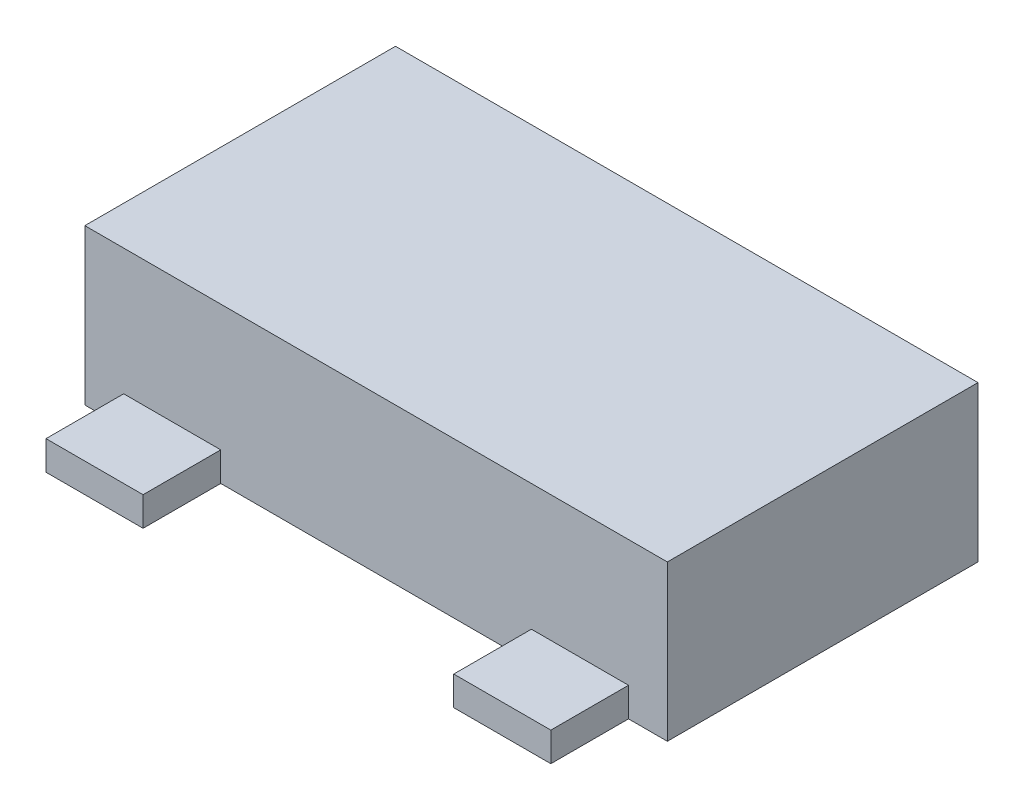
ISO-10303-21;
HEADER;
FILE_DESCRIPTION(('STEP AP214'),'2;1');
FILE_NAME('part.step','',(''),(''),'','','');
FILE_SCHEMA(('AUTOMOTIVE_DESIGN { 1 0 10303 214 1 1 1 1 }'));
ENDSEC;
DATA;
#1=APPLICATION_CONTEXT('core data for automotive mechanical design processes');
#2=APPLICATION_PROTOCOL_DEFINITION('international standard','automotive_design',2000,#1);
#3=PRODUCT_CONTEXT('',#1,'mechanical');
#4=PRODUCT('Part','Part','',(#3));
#5=PRODUCT_RELATED_PRODUCT_CATEGORY('part','',(#4));
#6=PRODUCT_DEFINITION_FORMATION('','',#4);
#7=PRODUCT_DEFINITION_CONTEXT('part definition',#1,'design');
#8=PRODUCT_DEFINITION('design','',#6,#7);
#9=PRODUCT_DEFINITION_SHAPE('','',#8);
#10=(LENGTH_UNIT() NAMED_UNIT(*) SI_UNIT(.MILLI.,.METRE.));
#11=(NAMED_UNIT(*) PLANE_ANGLE_UNIT() SI_UNIT($,.RADIAN.));
#12=(NAMED_UNIT(*) SI_UNIT($,.STERADIAN.) SOLID_ANGLE_UNIT());
#13=UNCERTAINTY_MEASURE_WITH_UNIT(LENGTH_MEASURE(1.E-05),#10,'distance_accuracy_value','');
#14=(GEOMETRIC_REPRESENTATION_CONTEXT(3) GLOBAL_UNCERTAINTY_ASSIGNED_CONTEXT((#13)) GLOBAL_UNIT_ASSIGNED_CONTEXT((#10,
#11,#12)) REPRESENTATION_CONTEXT('',''));
#15=CARTESIAN_POINT('',(0.,0.,0.));
#16=DIRECTION('',(0.,0.,1.));
#17=DIRECTION('',(1.,0.,0.));
#18=AXIS2_PLACEMENT_3D('',#15,#16,#17);
#19=CARTESIAN_POINT('',(-1.5,0.8,0.8));
#20=DIRECTION('',(0.,0.,-1.));
#21=DIRECTION('',(-1.,0.,0.));
#22=AXIS2_PLACEMENT_3D('',#19,#20,#21);
#23=PLANE('',#22);
#24=DIRECTION('',(-1.,0.,0.));
#25=VECTOR('',#24,1.);
#26=CARTESIAN_POINT('',(1.3,0.15,0.8));
#27=LINE('',#26,#25);
#28=CARTESIAN_POINT('',(1.3,0.15,0.8));
#29=VERTEX_POINT('',#28);
#30=CARTESIAN_POINT('',(0.8,0.15,0.8));
#31=VERTEX_POINT('',#30);
#32=EDGE_CURVE('E53',#29,#31,#27,.T.);
#33=ORIENTED_EDGE('',*,*,#32,.F.);
#34=DIRECTION('',(0.,-1.,0.));
#35=VECTOR('',#34,1.);
#36=CARTESIAN_POINT('',(1.3,0.790312423743285,0.8));
#37=LINE('',#36,#35);
#38=CARTESIAN_POINT('',(1.3,0.,0.8));
#39=VERTEX_POINT('',#38);
#40=EDGE_CURVE('E161',#29,#39,#37,.T.);
#41=ORIENTED_EDGE('',*,*,#40,.T.);
#42=DIRECTION('',(1.,0.,0.));
#43=VECTOR('',#42,1.);
#44=CARTESIAN_POINT('',(-1.5,0.,0.8));
#45=LINE('',#44,#43);
#46=CARTESIAN_POINT('',(1.5,0.,0.8));
#47=VERTEX_POINT('',#46);
#48=EDGE_CURVE('E146',#39,#47,#45,.T.);
#49=ORIENTED_EDGE('',*,*,#48,.T.);
#50=DIRECTION('',(0.,-1.,0.));
#51=VECTOR('',#50,1.);
#52=CARTESIAN_POINT('',(1.5,0.8,0.8));
#53=LINE('',#52,#51);
#54=CARTESIAN_POINT('',(1.5,0.8,0.8));
#55=VERTEX_POINT('',#54);
#56=EDGE_CURVE('E248',#55,#47,#53,.T.);
#57=ORIENTED_EDGE('',*,*,#56,.F.);
#58=DIRECTION('',(1.,0.,0.));
#59=VECTOR('',#58,1.);
#60=CARTESIAN_POINT('',(-1.5,0.8,0.8));
#61=LINE('',#60,#59);
#62=CARTESIAN_POINT('',(-1.5,0.8,0.8));
#63=VERTEX_POINT('',#62);
#64=EDGE_CURVE('E246',#63,#55,#61,.T.);
#65=ORIENTED_EDGE('',*,*,#64,.F.);
#66=DIRECTION('',(0.,-1.,0.));
#67=VECTOR('',#66,1.);
#68=CARTESIAN_POINT('',(-1.5,0.8,0.8));
#69=LINE('',#68,#67);
#70=CARTESIAN_POINT('',(-1.5,0.,0.8));
#71=VERTEX_POINT('',#70);
#72=EDGE_CURVE('E257',#63,#71,#69,.T.);
#73=ORIENTED_EDGE('',*,*,#72,.T.);
#74=CARTESIAN_POINT('',(-1.3,0.,0.8));
#75=VERTEX_POINT('',#74);
#76=EDGE_CURVE('E159',#71,#75,#45,.T.);
#77=ORIENTED_EDGE('',*,*,#76,.T.);
#78=DIRECTION('',(0.,-1.,0.));
#79=VECTOR('',#78,1.);
#80=CARTESIAN_POINT('',(-1.3,0.790312423743285,0.8));
#81=LINE('',#80,#79);
#82=CARTESIAN_POINT('',(-1.3,0.15,0.8));
#83=VERTEX_POINT('',#82);
#84=EDGE_CURVE('E204',#83,#75,#81,.T.);
#85=ORIENTED_EDGE('',*,*,#84,.F.);
#86=DIRECTION('',(1.,0.,0.));
#87=VECTOR('',#86,1.);
#88=CARTESIAN_POINT('',(-1.3,0.15,0.8));
#89=LINE('',#88,#87);
#90=CARTESIAN_POINT('',(-0.8,0.15,0.8));
#91=VERTEX_POINT('',#90);
#92=EDGE_CURVE('E190',#83,#91,#89,.T.);
#93=ORIENTED_EDGE('',*,*,#92,.T.);
#94=DIRECTION('',(0.,-1.,0.));
#95=VECTOR('',#94,1.);
#96=CARTESIAN_POINT('',(-0.8,0.790312423743285,0.8));
#97=LINE('',#96,#95);
#98=CARTESIAN_POINT('',(-0.8,0.,0.8));
#99=VERTEX_POINT('',#98);
#100=EDGE_CURVE('E206',#91,#99,#97,.T.);
#101=ORIENTED_EDGE('',*,*,#100,.T.);
#102=CARTESIAN_POINT('',(0.8,0.,0.8));
#103=VERTEX_POINT('',#102);
#104=EDGE_CURVE('E156',#99,#103,#45,.T.);
#105=ORIENTED_EDGE('',*,*,#104,.T.);
#106=DIRECTION('',(0.,-1.,0.));
#107=VECTOR('',#106,1.);
#108=CARTESIAN_POINT('',(0.8,0.790312423743285,0.8));
#109=LINE('',#108,#107);
#110=EDGE_CURVE('E49',#31,#103,#109,.T.);
#111=ORIENTED_EDGE('',*,*,#110,.F.);
#112=EDGE_LOOP('',(#33,#41,#49,#57,#65,#73,#77,#85,#93,#101,#105,#111));
#113=FACE_BOUND('',#112,.T.);
#114=ADVANCED_FACE('F34',(#113),#23,.F.);
#115=CARTESIAN_POINT('',(-1.5,0.8,-0.8));
#116=DIRECTION('',(0.,0.,1.));
#117=DIRECTION('',(1.,0.,0.));
#118=AXIS2_PLACEMENT_3D('',#115,#116,#117);
#119=PLANE('',#118);
#120=DIRECTION('',(0.,-1.,0.));
#121=VECTOR('',#120,1.);
#122=CARTESIAN_POINT('',(0.25,0.15,-0.8));
#123=LINE('',#122,#121);
#124=CARTESIAN_POINT('',(0.25,0.15,-0.8));
#125=VERTEX_POINT('',#124);
#126=CARTESIAN_POINT('',(0.25,0.,-0.8));
#127=VERTEX_POINT('',#126);
#128=EDGE_CURVE('E234',#125,#127,#123,.T.);
#129=ORIENTED_EDGE('',*,*,#128,.F.);
#130=DIRECTION('',(1.,0.,0.));
#131=VECTOR('',#130,1.);
#132=CARTESIAN_POINT('',(-0.25,0.15,-0.8));
#133=LINE('',#132,#131);
#134=CARTESIAN_POINT('',(-0.25,0.15,-0.8));
#135=VERTEX_POINT('',#134);
#136=EDGE_CURVE('E217',#135,#125,#133,.T.);
#137=ORIENTED_EDGE('',*,*,#136,.F.);
#138=DIRECTION('',(0.,-1.,0.));
#139=VECTOR('',#138,1.);
#140=CARTESIAN_POINT('',(-0.25,0.15,-0.8));
#141=LINE('',#140,#139);
#142=CARTESIAN_POINT('',(-0.25,0.,-0.8));
#143=VERTEX_POINT('',#142);
#144=EDGE_CURVE('E236',#135,#143,#141,.T.);
#145=ORIENTED_EDGE('',*,*,#144,.T.);
#146=DIRECTION('',(-1.,0.,0.));
#147=VECTOR('',#146,1.);
#148=CARTESIAN_POINT('',(-1.5,0.,-0.8));
#149=LINE('',#148,#147);
#150=CARTESIAN_POINT('',(-1.5,0.,-0.8));
#151=VERTEX_POINT('',#150);
#152=EDGE_CURVE('E250',#143,#151,#149,.T.);
#153=ORIENTED_EDGE('',*,*,#152,.T.);
#154=DIRECTION('',(0.,-1.,0.));
#155=VECTOR('',#154,1.);
#156=CARTESIAN_POINT('',(-1.5,0.8,-0.8));
#157=LINE('',#156,#155);
#158=CARTESIAN_POINT('',(-1.5,0.8,-0.8));
#159=VERTEX_POINT('',#158);
#160=EDGE_CURVE('E42',#159,#151,#157,.T.);
#161=ORIENTED_EDGE('',*,*,#160,.F.);
#162=DIRECTION('',(-1.,0.,0.));
#163=VECTOR('',#162,1.);
#164=CARTESIAN_POINT('',(-1.5,0.8,-0.8));
#165=LINE('',#164,#163);
#166=CARTESIAN_POINT('',(1.5,0.8,-0.8));
#167=VERTEX_POINT('',#166);
#168=EDGE_CURVE('E242',#167,#159,#165,.T.);
#169=ORIENTED_EDGE('',*,*,#168,.F.);
#170=DIRECTION('',(0.,-1.,0.));
#171=VECTOR('',#170,1.);
#172=CARTESIAN_POINT('',(1.5,0.8,-0.8));
#173=LINE('',#172,#171);
#174=CARTESIAN_POINT('',(1.5,0.,-0.8));
#175=VERTEX_POINT('',#174);
#176=EDGE_CURVE('E11',#167,#175,#173,.T.);
#177=ORIENTED_EDGE('',*,*,#176,.T.);
#178=EDGE_CURVE('E251',#175,#127,#149,.T.);
#179=ORIENTED_EDGE('',*,*,#178,.T.);
#180=EDGE_LOOP('',(#129,#137,#145,#153,#161,#169,#177,#179));
#181=FACE_BOUND('',#180,.T.);
#182=ADVANCED_FACE('F279',(#181),#119,.F.);
#183=CARTESIAN_POINT('',(1.5,0.8,-0.8));
#184=DIRECTION('',(-1.,0.,0.));
#185=DIRECTION('',(0.,0.,1.));
#186=AXIS2_PLACEMENT_3D('',#183,#184,#185);
#187=PLANE('',#186);
#188=DIRECTION('',(0.,0.,-1.));
#189=VECTOR('',#188,1.);
#190=CARTESIAN_POINT('',(1.5,0.,-0.8));
#191=LINE('',#190,#189);
#192=EDGE_CURVE('E153',#47,#175,#191,.T.);
#193=ORIENTED_EDGE('',*,*,#192,.T.);
#194=ORIENTED_EDGE('',*,*,#176,.F.);
#195=DIRECTION('',(0.,0.,-1.));
#196=VECTOR('',#195,1.);
#197=CARTESIAN_POINT('',(1.5,0.8,-0.8));
#198=LINE('',#197,#196);
#199=EDGE_CURVE('E239',#55,#167,#198,.T.);
#200=ORIENTED_EDGE('',*,*,#199,.F.);
#201=ORIENTED_EDGE('',*,*,#56,.T.);
#202=EDGE_LOOP('',(#193,#194,#200,#201));
#203=FACE_BOUND('',#202,.T.);
#204=ADVANCED_FACE('F36',(#203),#187,.F.);
#205=CARTESIAN_POINT('',(-1.5,0.8,-0.8));
#206=DIRECTION('',(1.,0.,0.));
#207=DIRECTION('',(0.,0.,-1.));
#208=AXIS2_PLACEMENT_3D('',#205,#206,#207);
#209=PLANE('',#208);
#210=DIRECTION('',(0.,0.,1.));
#211=VECTOR('',#210,1.);
#212=CARTESIAN_POINT('',(-1.5,0.,-0.8));
#213=LINE('',#212,#211);
#214=EDGE_CURVE('E157',#151,#71,#213,.T.);
#215=ORIENTED_EDGE('',*,*,#214,.T.);
#216=ORIENTED_EDGE('',*,*,#72,.F.);
#217=DIRECTION('',(0.,0.,1.));
#218=VECTOR('',#217,1.);
#219=CARTESIAN_POINT('',(-1.5,0.8,-0.8));
#220=LINE('',#219,#218);
#221=EDGE_CURVE('E244',#159,#63,#220,.T.);
#222=ORIENTED_EDGE('',*,*,#221,.F.);
#223=ORIENTED_EDGE('',*,*,#160,.T.);
#224=EDGE_LOOP('',(#215,#216,#222,#223));
#225=FACE_BOUND('',#224,.T.);
#226=ADVANCED_FACE('F264',(#225),#209,.F.);
#227=CARTESIAN_POINT('',(0.,0.8,0.));
#228=DIRECTION('',(0.,1.,0.));
#229=DIRECTION('',(0.,0.,1.));
#230=AXIS2_PLACEMENT_3D('',#227,#228,#229);
#231=PLANE('',#230);
#232=ORIENTED_EDGE('',*,*,#199,.T.);
#233=ORIENTED_EDGE('',*,*,#168,.T.);
#234=ORIENTED_EDGE('',*,*,#221,.T.);
#235=ORIENTED_EDGE('',*,*,#64,.T.);
#236=EDGE_LOOP('',(#232,#233,#234,#235));
#237=FACE_BOUND('',#236,.T.);
#238=ADVANCED_FACE('F276',(#237),#231,.T.);
#239=CARTESIAN_POINT('',(0.,0.,0.));
#240=DIRECTION('',(0.,1.,0.));
#241=DIRECTION('',(0.,0.,1.));
#242=AXIS2_PLACEMENT_3D('',#239,#240,#241);
#243=PLANE('',#242);
#244=ORIENTED_EDGE('',*,*,#192,.F.);
#245=ORIENTED_EDGE('',*,*,#48,.F.);
#246=DIRECTION('',(0.,0.,1.));
#247=VECTOR('',#246,1.);
#248=CARTESIAN_POINT('',(1.3,0.,0.8));
#249=LINE('',#248,#247);
#250=CARTESIAN_POINT('',(1.3,0.,1.2));
#251=VERTEX_POINT('',#250);
#252=EDGE_CURVE('E150',#39,#251,#249,.T.);
#253=ORIENTED_EDGE('',*,*,#252,.T.);
#254=DIRECTION('',(-1.,0.,0.));
#255=VECTOR('',#254,1.);
#256=CARTESIAN_POINT('',(1.3,0.,1.2));
#257=LINE('',#256,#255);
#258=CARTESIAN_POINT('',(0.8,0.,1.2));
#259=VERTEX_POINT('',#258);
#260=EDGE_CURVE('E172',#251,#259,#257,.T.);
#261=ORIENTED_EDGE('',*,*,#260,.T.);
#262=DIRECTION('',(0.,0.,-1.));
#263=VECTOR('',#262,1.);
#264=CARTESIAN_POINT('',(0.8,0.,0.8));
#265=LINE('',#264,#263);
#266=EDGE_CURVE('E169',#259,#103,#265,.T.);
#267=ORIENTED_EDGE('',*,*,#266,.T.);
#268=ORIENTED_EDGE('',*,*,#104,.F.);
#269=DIRECTION('',(0.,0.,-1.));
#270=VECTOR('',#269,1.);
#271=CARTESIAN_POINT('',(-0.8,0.,0.8));
#272=LINE('',#271,#270);
#273=CARTESIAN_POINT('',(-0.8,0.,1.2));
#274=VERTEX_POINT('',#273);
#275=EDGE_CURVE('E202',#274,#99,#272,.T.);
#276=ORIENTED_EDGE('',*,*,#275,.F.);
#277=DIRECTION('',(1.,0.,0.));
#278=VECTOR('',#277,1.);
#279=CARTESIAN_POINT('',(-1.3,0.,1.2));
#280=LINE('',#279,#278);
#281=CARTESIAN_POINT('',(-1.3,0.,1.2));
#282=VERTEX_POINT('',#281);
#283=EDGE_CURVE('E199',#282,#274,#280,.T.);
#284=ORIENTED_EDGE('',*,*,#283,.F.);
#285=DIRECTION('',(0.,0.,1.));
#286=VECTOR('',#285,1.);
#287=CARTESIAN_POINT('',(-1.3,0.,0.8));
#288=LINE('',#287,#286);
#289=EDGE_CURVE('E185',#75,#282,#288,.T.);
#290=ORIENTED_EDGE('',*,*,#289,.F.);
#291=ORIENTED_EDGE('',*,*,#76,.F.);
#292=ORIENTED_EDGE('',*,*,#214,.F.);
#293=ORIENTED_EDGE('',*,*,#152,.F.);
#294=DIRECTION('',(0.,0.,1.));
#295=VECTOR('',#294,1.);
#296=CARTESIAN_POINT('',(-0.25,0.,-0.8));
#297=LINE('',#296,#295);
#298=CARTESIAN_POINT('',(-0.25,0.,-1.2));
#299=VERTEX_POINT('',#298);
#300=EDGE_CURVE('E196',#299,#143,#297,.T.);
#301=ORIENTED_EDGE('',*,*,#300,.F.);
#302=DIRECTION('',(-1.,0.,0.));
#303=VECTOR('',#302,1.);
#304=CARTESIAN_POINT('',(-0.25,0.,-1.2));
#305=LINE('',#304,#303);
#306=CARTESIAN_POINT('',(0.25,0.,-1.2));
#307=VERTEX_POINT('',#306);
#308=EDGE_CURVE('E218',#307,#299,#305,.T.);
#309=ORIENTED_EDGE('',*,*,#308,.F.);
#310=DIRECTION('',(0.,0.,-1.));
#311=VECTOR('',#310,1.);
#312=CARTESIAN_POINT('',(0.25,0.,-0.8));
#313=LINE('',#312,#311);
#314=EDGE_CURVE('E226',#127,#307,#313,.T.);
#315=ORIENTED_EDGE('',*,*,#314,.F.);
#316=ORIENTED_EDGE('',*,*,#178,.F.);
#317=EDGE_LOOP('',(#244,#245,#253,#261,#267,#268,#276,#284,#290,#291,#292,#293,#301,#309,#315,#316));
#318=FACE_BOUND('',#317,.T.);
#319=ADVANCED_FACE('F147',(#318),#243,.F.);
#320=CARTESIAN_POINT('',(-0.25,0.15,-0.8));
#321=DIRECTION('',(1.,0.,0.));
#322=DIRECTION('',(0.,0.,-1.));
#323=AXIS2_PLACEMENT_3D('',#320,#321,#322);
#324=PLANE('',#323);
#325=ORIENTED_EDGE('',*,*,#300,.T.);
#326=ORIENTED_EDGE('',*,*,#144,.F.);
#327=DIRECTION('',(0.,0.,1.));
#328=VECTOR('',#327,1.);
#329=CARTESIAN_POINT('',(-0.25,0.15,-0.8));
#330=LINE('',#329,#328);
#331=CARTESIAN_POINT('',(-0.25,0.15,-1.2));
#332=VERTEX_POINT('',#331);
#333=EDGE_CURVE('E215',#332,#135,#330,.T.);
#334=ORIENTED_EDGE('',*,*,#333,.F.);
#335=DIRECTION('',(0.,-1.,0.));
#336=VECTOR('',#335,1.);
#337=CARTESIAN_POINT('',(-0.25,0.15,-1.2));
#338=LINE('',#337,#336);
#339=EDGE_CURVE('E224',#332,#299,#338,.T.);
#340=ORIENTED_EDGE('',*,*,#339,.T.);
#341=EDGE_LOOP('',(#325,#326,#334,#340));
#342=FACE_BOUND('',#341,.T.);
#343=ADVANCED_FACE('F294',(#342),#324,.F.);
#344=CARTESIAN_POINT('',(0.25,0.15,-0.8));
#345=DIRECTION('',(-1.,0.,0.));
#346=DIRECTION('',(0.,0.,1.));
#347=AXIS2_PLACEMENT_3D('',#344,#345,#346);
#348=PLANE('',#347);
#349=ORIENTED_EDGE('',*,*,#314,.T.);
#350=DIRECTION('',(0.,-1.,0.));
#351=VECTOR('',#350,1.);
#352=CARTESIAN_POINT('',(0.25,0.15,-1.2));
#353=LINE('',#352,#351);
#354=CARTESIAN_POINT('',(0.25,0.15,-1.2));
#355=VERTEX_POINT('',#354);
#356=EDGE_CURVE('E231',#355,#307,#353,.T.);
#357=ORIENTED_EDGE('',*,*,#356,.F.);
#358=DIRECTION('',(0.,0.,-1.));
#359=VECTOR('',#358,1.);
#360=CARTESIAN_POINT('',(0.25,0.15,-0.8));
#361=LINE('',#360,#359);
#362=EDGE_CURVE('E220',#125,#355,#361,.T.);
#363=ORIENTED_EDGE('',*,*,#362,.F.);
#364=ORIENTED_EDGE('',*,*,#128,.T.);
#365=EDGE_LOOP('',(#349,#357,#363,#364));
#366=FACE_BOUND('',#365,.T.);
#367=ADVANCED_FACE('F299',(#366),#348,.F.);
#368=CARTESIAN_POINT('',(-0.25,0.15,-1.2));
#369=DIRECTION('',(0.,0.,1.));
#370=DIRECTION('',(1.,0.,0.));
#371=AXIS2_PLACEMENT_3D('',#368,#369,#370);
#372=PLANE('',#371);
#373=ORIENTED_EDGE('',*,*,#308,.T.);
#374=ORIENTED_EDGE('',*,*,#339,.F.);
#375=DIRECTION('',(-1.,0.,0.));
#376=VECTOR('',#375,1.);
#377=CARTESIAN_POINT('',(-0.25,0.15,-1.2));
#378=LINE('',#377,#376);
#379=EDGE_CURVE('E222',#355,#332,#378,.T.);
#380=ORIENTED_EDGE('',*,*,#379,.F.);
#381=ORIENTED_EDGE('',*,*,#356,.T.);
#382=EDGE_LOOP('',(#373,#374,#380,#381));
#383=FACE_BOUND('',#382,.T.);
#384=ADVANCED_FACE('F303',(#383),#372,.F.);
#385=CARTESIAN_POINT('',(0.,0.15,0.));
#386=DIRECTION('',(0.,-1.,0.));
#387=DIRECTION('',(0.,0.,-1.));
#388=AXIS2_PLACEMENT_3D('',#385,#386,#387);
#389=PLANE('',#388);
#390=ORIENTED_EDGE('',*,*,#333,.T.);
#391=ORIENTED_EDGE('',*,*,#136,.T.);
#392=ORIENTED_EDGE('',*,*,#362,.T.);
#393=ORIENTED_EDGE('',*,*,#379,.T.);
#394=EDGE_LOOP('',(#390,#391,#392,#393));
#395=FACE_BOUND('',#394,.T.);
#396=ADVANCED_FACE('F307',(#395),#389,.F.);
#397=CARTESIAN_POINT('',(-0.8,0.790312423743285,0.8));
#398=DIRECTION('',(-1.,0.,0.));
#399=DIRECTION('',(0.,0.,1.));
#400=AXIS2_PLACEMENT_3D('',#397,#398,#399);
#401=PLANE('',#400);
#402=ORIENTED_EDGE('',*,*,#100,.F.);
#403=DIRECTION('',(0.,0.,1.));
#404=VECTOR('',#403,1.);
#405=CARTESIAN_POINT('',(-0.8,0.15,0.8));
#406=LINE('',#405,#404);
#407=CARTESIAN_POINT('',(-0.8,0.15,1.2));
#408=VERTEX_POINT('',#407);
#409=EDGE_CURVE('E186',#91,#408,#406,.T.);
#410=ORIENTED_EDGE('',*,*,#409,.T.);
#411=DIRECTION('',(0.,-1.,0.));
#412=VECTOR('',#411,1.);
#413=CARTESIAN_POINT('',(-0.8,0.790312423743285,1.2));
#414=LINE('',#413,#412);
#415=EDGE_CURVE('E209',#408,#274,#414,.T.);
#416=ORIENTED_EDGE('',*,*,#415,.T.);
#417=ORIENTED_EDGE('',*,*,#275,.T.);
#418=EDGE_LOOP('',(#402,#410,#416,#417));
#419=FACE_BOUND('',#418,.T.);
#420=ADVANCED_FACE('F311',(#419),#401,.F.);
#421=CARTESIAN_POINT('',(-1.3,0.790312423743285,1.2));
#422=DIRECTION('',(0.,0.,-1.));
#423=DIRECTION('',(-1.,0.,0.));
#424=AXIS2_PLACEMENT_3D('',#421,#422,#423);
#425=PLANE('',#424);
#426=ORIENTED_EDGE('',*,*,#415,.F.);
#427=DIRECTION('',(-1.,0.,0.));
#428=VECTOR('',#427,1.);
#429=CARTESIAN_POINT('',(-1.3,0.15,1.2));
#430=LINE('',#429,#428);
#431=CARTESIAN_POINT('',(-1.3,0.15,1.2));
#432=VERTEX_POINT('',#431);
#433=EDGE_CURVE('E189',#408,#432,#430,.T.);
#434=ORIENTED_EDGE('',*,*,#433,.T.);
#435=DIRECTION('',(0.,-1.,0.));
#436=VECTOR('',#435,1.);
#437=CARTESIAN_POINT('',(-1.3,0.790312423743285,1.2));
#438=LINE('',#437,#436);
#439=EDGE_CURVE('E211',#432,#282,#438,.T.);
#440=ORIENTED_EDGE('',*,*,#439,.T.);
#441=ORIENTED_EDGE('',*,*,#283,.T.);
#442=EDGE_LOOP('',(#426,#434,#440,#441));
#443=FACE_BOUND('',#442,.T.);
#444=ADVANCED_FACE('F317',(#443),#425,.F.);
#445=CARTESIAN_POINT('',(-1.3,0.790312423743285,0.8));
#446=DIRECTION('',(1.,0.,0.));
#447=DIRECTION('',(0.,0.,-1.));
#448=AXIS2_PLACEMENT_3D('',#445,#446,#447);
#449=PLANE('',#448);
#450=ORIENTED_EDGE('',*,*,#439,.F.);
#451=DIRECTION('',(0.,0.,-1.));
#452=VECTOR('',#451,1.);
#453=CARTESIAN_POINT('',(-1.3,0.15,0.8));
#454=LINE('',#453,#452);
#455=EDGE_CURVE('E193',#432,#83,#454,.T.);
#456=ORIENTED_EDGE('',*,*,#455,.T.);
#457=ORIENTED_EDGE('',*,*,#84,.T.);
#458=ORIENTED_EDGE('',*,*,#289,.T.);
#459=EDGE_LOOP('',(#450,#456,#457,#458));
#460=FACE_BOUND('',#459,.T.);
#461=ADVANCED_FACE('F313',(#460),#449,.F.);
#462=CARTESIAN_POINT('',(0.,0.15,0.));
#463=DIRECTION('',(0.,-1.,0.));
#464=DIRECTION('',(0.,0.,-1.));
#465=AXIS2_PLACEMENT_3D('',#462,#463,#464);
#466=PLANE('',#465);
#467=ORIENTED_EDGE('',*,*,#433,.F.);
#468=ORIENTED_EDGE('',*,*,#409,.F.);
#469=ORIENTED_EDGE('',*,*,#92,.F.);
#470=ORIENTED_EDGE('',*,*,#455,.F.);
#471=EDGE_LOOP('',(#467,#468,#469,#470));
#472=FACE_BOUND('',#471,.T.);
#473=ADVANCED_FACE('F316',(#472),#466,.F.);
#474=CARTESIAN_POINT('',(1.3,0.790312423743285,0.8));
#475=DIRECTION('',(1.,0.,0.));
#476=DIRECTION('',(0.,0.,-1.));
#477=AXIS2_PLACEMENT_3D('',#474,#475,#476);
#478=PLANE('',#477);
#479=DIRECTION('',(0.,0.,-1.));
#480=VECTOR('',#479,1.);
#481=CARTESIAN_POINT('',(1.3,0.15,0.8));
#482=LINE('',#481,#480);
#483=CARTESIAN_POINT('',(1.3,0.15,1.2));
#484=VERTEX_POINT('',#483);
#485=EDGE_CURVE('E175',#484,#29,#482,.T.);
#486=ORIENTED_EDGE('',*,*,#485,.F.);
#487=DIRECTION('',(0.,-1.,0.));
#488=VECTOR('',#487,1.);
#489=CARTESIAN_POINT('',(1.3,0.790312423743285,1.2));
#490=LINE('',#489,#488);
#491=EDGE_CURVE('E168',#484,#251,#490,.T.);
#492=ORIENTED_EDGE('',*,*,#491,.T.);
#493=ORIENTED_EDGE('',*,*,#252,.F.);
#494=ORIENTED_EDGE('',*,*,#40,.F.);
#495=EDGE_LOOP('',(#486,#492,#493,#494));
#496=FACE_BOUND('',#495,.T.);
#497=ADVANCED_FACE('F166',(#496),#478,.T.);
#498=CARTESIAN_POINT('',(0.8,0.790312423743285,0.8));
#499=DIRECTION('',(-1.,0.,0.));
#500=DIRECTION('',(0.,0.,1.));
#501=AXIS2_PLACEMENT_3D('',#498,#499,#500);
#502=PLANE('',#501);
#503=DIRECTION('',(0.,0.,1.));
#504=VECTOR('',#503,1.);
#505=CARTESIAN_POINT('',(0.8,0.15,0.8));
#506=LINE('',#505,#504);
#507=CARTESIAN_POINT('',(0.8,0.15,1.2));
#508=VERTEX_POINT('',#507);
#509=EDGE_CURVE('E164',#31,#508,#506,.T.);
#510=ORIENTED_EDGE('',*,*,#509,.F.);
#511=ORIENTED_EDGE('',*,*,#110,.T.);
#512=ORIENTED_EDGE('',*,*,#266,.F.);
#513=DIRECTION('',(0.,-1.,0.));
#514=VECTOR('',#513,1.);
#515=CARTESIAN_POINT('',(0.8,0.790312423743285,1.2));
#516=LINE('',#515,#514);
#517=EDGE_CURVE('E180',#508,#259,#516,.T.);
#518=ORIENTED_EDGE('',*,*,#517,.F.);
#519=EDGE_LOOP('',(#510,#511,#512,#518));
#520=FACE_BOUND('',#519,.T.);
#521=ADVANCED_FACE('F330',(#520),#502,.T.);
#522=CARTESIAN_POINT('',(1.3,0.790312423743285,1.2));
#523=DIRECTION('',(0.,0.,1.));
#524=DIRECTION('',(1.,0.,0.));
#525=AXIS2_PLACEMENT_3D('',#522,#523,#524);
#526=PLANE('',#525);
#527=DIRECTION('',(1.,0.,0.));
#528=VECTOR('',#527,1.);
#529=CARTESIAN_POINT('',(1.3,0.15,1.2));
#530=LINE('',#529,#528);
#531=EDGE_CURVE('E183',#508,#484,#530,.T.);
#532=ORIENTED_EDGE('',*,*,#531,.F.);
#533=ORIENTED_EDGE('',*,*,#517,.T.);
#534=ORIENTED_EDGE('',*,*,#260,.F.);
#535=ORIENTED_EDGE('',*,*,#491,.F.);
#536=EDGE_LOOP('',(#532,#533,#534,#535));
#537=FACE_BOUND('',#536,.T.);
#538=ADVANCED_FACE('F333',(#537),#526,.T.);
#539=CARTESIAN_POINT('',(0.,0.15,0.));
#540=DIRECTION('',(0.,-1.,0.));
#541=DIRECTION('',(0.,0.,-1.));
#542=AXIS2_PLACEMENT_3D('',#539,#540,#541);
#543=PLANE('',#542);
#544=ORIENTED_EDGE('',*,*,#485,.T.);
#545=ORIENTED_EDGE('',*,*,#32,.T.);
#546=ORIENTED_EDGE('',*,*,#509,.T.);
#547=ORIENTED_EDGE('',*,*,#531,.T.);
#548=EDGE_LOOP('',(#544,#545,#546,#547));
#549=FACE_BOUND('',#548,.T.);
#550=ADVANCED_FACE('F337',(#549),#543,.F.);
#551=CLOSED_SHELL('',(#114,#182,#204,#226,#238,#319,#343,#367,#384,#396,#420,#444,#461,#473,
#497,#521,#538,#550));
#552=MANIFOLD_SOLID_BREP('B2',#551);
#553=ADVANCED_BREP_SHAPE_REPRESENTATION('',(#18,#552),#14);
#554=SHAPE_DEFINITION_REPRESENTATION(#9,#553);
ENDSEC;
END-ISO-10303-21;
